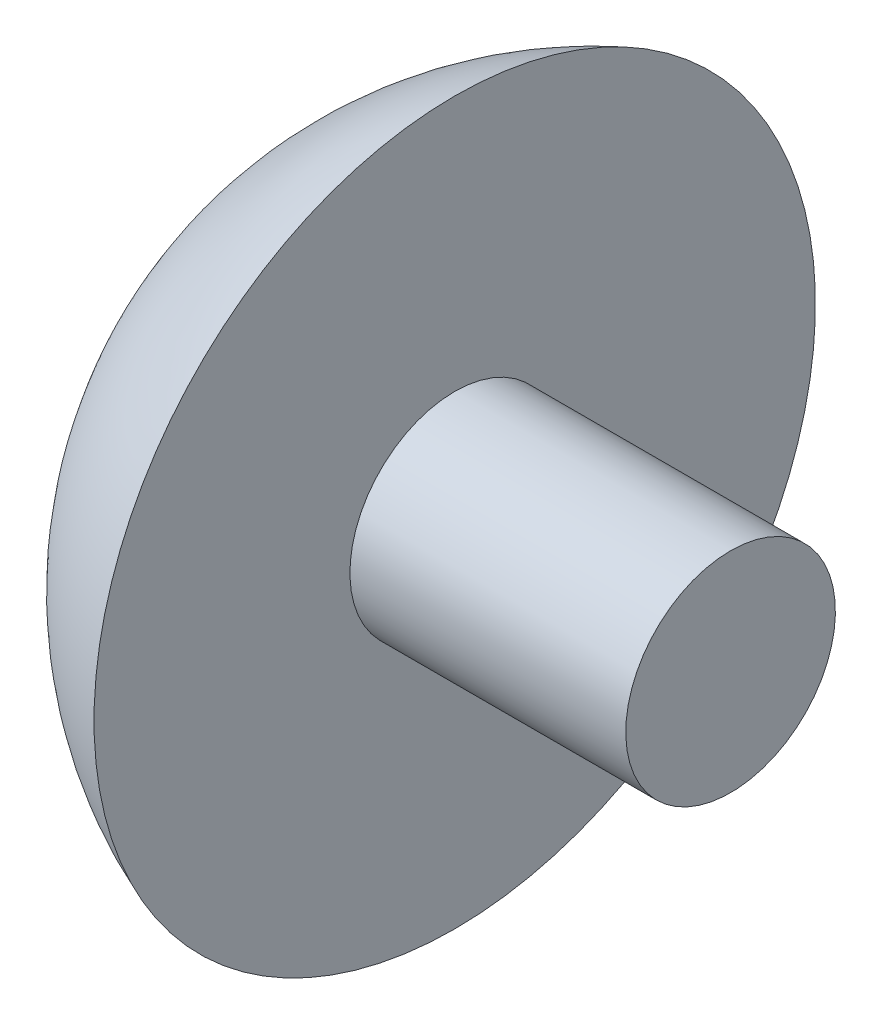
ISO-10303-21;
HEADER;
FILE_DESCRIPTION(('STEP AP214'),'2;1');
FILE_NAME('part.step','',(''),(''),'','','');
FILE_SCHEMA(('AUTOMOTIVE_DESIGN { 1 0 10303 214 1 1 1 1 }'));
ENDSEC;
DATA;
#1=APPLICATION_CONTEXT('core data for automotive mechanical design processes');
#2=APPLICATION_PROTOCOL_DEFINITION('international standard','automotive_design',2000,#1);
#3=PRODUCT_CONTEXT('',#1,'mechanical');
#4=PRODUCT('Part','Part','',(#3));
#5=PRODUCT_RELATED_PRODUCT_CATEGORY('part','',(#4));
#6=PRODUCT_DEFINITION_FORMATION('','',#4);
#7=PRODUCT_DEFINITION_CONTEXT('part definition',#1,'design');
#8=PRODUCT_DEFINITION('design','',#6,#7);
#9=PRODUCT_DEFINITION_SHAPE('','',#8);
#10=(LENGTH_UNIT() NAMED_UNIT(*) SI_UNIT(.MILLI.,.METRE.));
#11=(NAMED_UNIT(*) PLANE_ANGLE_UNIT() SI_UNIT($,.RADIAN.));
#12=(NAMED_UNIT(*) SI_UNIT($,.STERADIAN.) SOLID_ANGLE_UNIT());
#13=UNCERTAINTY_MEASURE_WITH_UNIT(LENGTH_MEASURE(1.E-05),#10,'distance_accuracy_value','');
#14=(GEOMETRIC_REPRESENTATION_CONTEXT(3) GLOBAL_UNCERTAINTY_ASSIGNED_CONTEXT((#13)) GLOBAL_UNIT_ASSIGNED_CONTEXT((#10,
#11,#12)) REPRESENTATION_CONTEXT('',''));
#15=CARTESIAN_POINT('',(0.,0.,0.));
#16=DIRECTION('',(0.,0.,1.));
#17=DIRECTION('',(1.,0.,0.));
#18=AXIS2_PLACEMENT_3D('',#15,#16,#17);
#19=CARTESIAN_POINT('',(0.,0.,0.));
#20=DIRECTION('',(-1.,0.,0.));
#21=DIRECTION('',(0.,-1.,0.));
#22=AXIS2_PLACEMENT_3D('',#19,#20,#21);
#23=PLANE('',#22);
#24=CARTESIAN_POINT('',(0.,0.,0.));
#25=DIRECTION('',(1.,0.,0.));
#26=DIRECTION('',(0.,1.,0.));
#27=AXIS2_PLACEMENT_3D('',#24,#25,#26);
#28=CIRCLE('',#27,1.9);
#29=CARTESIAN_POINT('',(0.,1.9,0.));
#30=VERTEX_POINT('',#29);
#31=EDGE_CURVE('E40',#30,#30,#28,.T.);
#32=ORIENTED_EDGE('',*,*,#31,.T.);
#33=EDGE_LOOP('',(#32));
#34=FACE_BOUND('',#33,.T.);
#35=ADVANCED_FACE('F30',(#34),#23,.F.);
#36=CARTESIAN_POINT('',(-2.5,0.,0.));
#37=DIRECTION('',(1.,0.,0.));
#38=DIRECTION('',(0.,-1.,0.));
#39=AXIS2_PLACEMENT_3D('',#36,#37,#38);
#40=SPHERICAL_SURFACE('',#39,7.);
#41=CARTESIAN_POINT('',(-5.00000000000001,0.,0.));
#42=DIRECTION('',(1.,0.,0.));
#43=DIRECTION('',(0.,1.,0.));
#44=AXIS2_PLACEMENT_3D('',#41,#42,#43);
#45=CIRCLE('',#44,6.53834841531101);
#46=CARTESIAN_POINT('',(-5.00000000000001,6.53834841531101,0.));
#47=VERTEX_POINT('',#46);
#48=EDGE_CURVE('E10',#47,#47,#45,.T.);
#49=ORIENTED_EDGE('',*,*,#48,.F.);
#50=EDGE_LOOP('',(#49));
#51=FACE_BOUND('',#50,.T.);
#52=ADVANCED_FACE('F55',(#51),#40,.T.);
#53=CARTESIAN_POINT('',(-5.,-1.9,0.));
#54=DIRECTION('',(-1.,0.,0.));
#55=DIRECTION('',(0.,-1.,0.));
#56=AXIS2_PLACEMENT_3D('',#53,#54,#55);
#57=PLANE('',#56);
#58=CARTESIAN_POINT('',(-5.,0.,0.));
#59=DIRECTION('',(1.,0.,0.));
#60=DIRECTION('',(0.,1.,0.));
#61=AXIS2_PLACEMENT_3D('',#58,#59,#60);
#62=CIRCLE('',#61,1.9);
#63=CARTESIAN_POINT('',(-5.,1.9,0.));
#64=VERTEX_POINT('',#63);
#65=EDGE_CURVE('E36',#64,#64,#62,.T.);
#66=ORIENTED_EDGE('',*,*,#65,.F.);
#67=EDGE_LOOP('',(#66));
#68=FACE_BOUND('',#67,.T.);
#69=ORIENTED_EDGE('',*,*,#48,.T.);
#70=EDGE_LOOP('',(#69));
#71=FACE_BOUND('',#70,.T.);
#72=ADVANCED_FACE('F50',(#68,#71),#57,.F.);
#73=CARTESIAN_POINT('',(0.,0.,0.));
#74=DIRECTION('',(1.,0.,0.));
#75=DIRECTION('',(0.,1.,0.));
#76=AXIS2_PLACEMENT_3D('',#73,#74,#75);
#77=CYLINDRICAL_SURFACE('',#76,1.9);
#78=ORIENTED_EDGE('',*,*,#31,.F.);
#79=EDGE_LOOP('',(#78));
#80=FACE_BOUND('',#79,.T.);
#81=ORIENTED_EDGE('',*,*,#65,.T.);
#82=EDGE_LOOP('',(#81));
#83=FACE_BOUND('',#82,.T.);
#84=ADVANCED_FACE('F48',(#80,#83),#77,.T.);
#85=CLOSED_SHELL('',(#35,#52,#72,#84));
#86=MANIFOLD_SOLID_BREP('B2',#85);
#87=ADVANCED_BREP_SHAPE_REPRESENTATION('',(#18,#86),#14);
#88=SHAPE_DEFINITION_REPRESENTATION(#9,#87);
ENDSEC;
END-ISO-10303-21;
